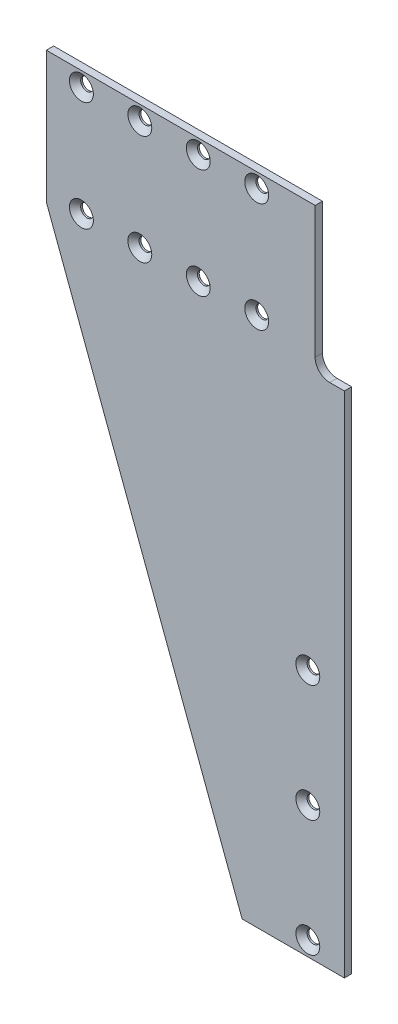
ISO-10303-21;
HEADER;
FILE_DESCRIPTION(('STEP AP214'),'2;1');
FILE_NAME('part.step','',(''),(''),'','','');
FILE_SCHEMA(('AUTOMOTIVE_DESIGN { 1 0 10303 214 1 1 1 1 }'));
ENDSEC;
DATA;
#1=APPLICATION_CONTEXT('core data for automotive mechanical design processes');
#2=APPLICATION_PROTOCOL_DEFINITION('international standard','automotive_design',2000,#1);
#3=PRODUCT_CONTEXT('',#1,'mechanical');
#4=PRODUCT('Part','Part','',(#3));
#5=PRODUCT_RELATED_PRODUCT_CATEGORY('part','',(#4));
#6=PRODUCT_DEFINITION_FORMATION('','',#4);
#7=PRODUCT_DEFINITION_CONTEXT('part definition',#1,'design');
#8=PRODUCT_DEFINITION('design','',#6,#7);
#9=PRODUCT_DEFINITION_SHAPE('','',#8);
#10=(LENGTH_UNIT() NAMED_UNIT(*) SI_UNIT(.MILLI.,.METRE.));
#11=(NAMED_UNIT(*) PLANE_ANGLE_UNIT() SI_UNIT($,.RADIAN.));
#12=(NAMED_UNIT(*) SI_UNIT($,.STERADIAN.) SOLID_ANGLE_UNIT());
#13=UNCERTAINTY_MEASURE_WITH_UNIT(LENGTH_MEASURE(1.E-05),#10,'distance_accuracy_value','');
#14=(GEOMETRIC_REPRESENTATION_CONTEXT(3) GLOBAL_UNCERTAINTY_ASSIGNED_CONTEXT((#13)) GLOBAL_UNIT_ASSIGNED_CONTEXT((#10,
#11,#12)) REPRESENTATION_CONTEXT('',''));
#15=CARTESIAN_POINT('',(0.,0.,0.));
#16=DIRECTION('',(0.,0.,1.));
#17=DIRECTION('',(1.,0.,0.));
#18=AXIS2_PLACEMENT_3D('',#15,#16,#17);
#19=CARTESIAN_POINT('',(-44.45,0.,-3.175));
#20=DIRECTION('',(0.,-1.,0.));
#21=DIRECTION('',(0.,0.,-1.));
#22=AXIS2_PLACEMENT_3D('',#19,#20,#21);
#23=PLANE('',#22);
#24=DIRECTION('',(1.,0.,0.));
#25=VECTOR('',#24,1.);
#26=CARTESIAN_POINT('',(-44.45,0.,0.));
#27=LINE('',#26,#25);
#28=CARTESIAN_POINT('',(-44.45,0.,0.));
#29=VERTEX_POINT('',#28);
#30=CARTESIAN_POINT('',(0.,0.,0.));
#31=VERTEX_POINT('',#30);
#32=EDGE_CURVE('E130',#29,#31,#27,.T.);
#33=ORIENTED_EDGE('',*,*,#32,.F.);
#34=DIRECTION('',(0.,0.,1.));
#35=VECTOR('',#34,1.);
#36=CARTESIAN_POINT('',(-44.45,0.,-3.175));
#37=LINE('',#36,#35);
#38=CARTESIAN_POINT('',(-44.45,0.,-3.175));
#39=VERTEX_POINT('',#38);
#40=EDGE_CURVE('E11',#39,#29,#37,.T.);
#41=ORIENTED_EDGE('',*,*,#40,.F.);
#42=DIRECTION('',(1.,0.,0.));
#43=VECTOR('',#42,1.);
#44=CARTESIAN_POINT('',(-44.45,0.,-3.175));
#45=LINE('',#44,#43);
#46=CARTESIAN_POINT('',(0.,0.,-3.175));
#47=VERTEX_POINT('',#46);
#48=EDGE_CURVE('E151',#39,#47,#45,.T.);
#49=ORIENTED_EDGE('',*,*,#48,.T.);
#50=DIRECTION('',(0.,0.,1.));
#51=VECTOR('',#50,1.);
#52=CARTESIAN_POINT('',(0.,0.,-3.175));
#53=LINE('',#52,#51);
#54=EDGE_CURVE('E36',#47,#31,#53,.T.);
#55=ORIENTED_EDGE('',*,*,#54,.T.);
#56=EDGE_LOOP('',(#33,#41,#49,#55));
#57=FACE_BOUND('',#56,.T.);
#58=ADVANCED_FACE('F33',(#57),#23,.T.);
#59=CARTESIAN_POINT('',(-129.54,227.33,-3.175));
#60=DIRECTION('',(-0.9365440193853,-0.350549996082766,0.));
#61=DIRECTION('',(0.350549996082766,-0.9365440193853,0.));
#62=AXIS2_PLACEMENT_3D('',#59,#60,#61);
#63=PLANE('',#62);
#64=DIRECTION('',(0.350549996082766,-0.9365440193853,0.));
#65=VECTOR('',#64,1.);
#66=CARTESIAN_POINT('',(-129.54,227.33,0.));
#67=LINE('',#66,#65);
#68=CARTESIAN_POINT('',(-129.54,227.33,0.));
#69=VERTEX_POINT('',#68);
#70=EDGE_CURVE('E149',#69,#29,#67,.T.);
#71=ORIENTED_EDGE('',*,*,#70,.F.);
#72=DIRECTION('',(0.,0.,1.));
#73=VECTOR('',#72,1.);
#74=CARTESIAN_POINT('',(-129.54,227.33,-3.175));
#75=LINE('',#74,#73);
#76=CARTESIAN_POINT('',(-129.54,227.33,-3.175));
#77=VERTEX_POINT('',#76);
#78=EDGE_CURVE('E42',#77,#69,#75,.T.);
#79=ORIENTED_EDGE('',*,*,#78,.F.);
#80=DIRECTION('',(0.350549996082766,-0.9365440193853,0.));
#81=VECTOR('',#80,1.);
#82=CARTESIAN_POINT('',(-129.54,227.33,-3.175));
#83=LINE('',#82,#81);
#84=EDGE_CURVE('E120',#77,#39,#83,.T.);
#85=ORIENTED_EDGE('',*,*,#84,.T.);
#86=ORIENTED_EDGE('',*,*,#40,.T.);
#87=EDGE_LOOP('',(#71,#79,#85,#86));
#88=FACE_BOUND('',#87,.T.);
#89=ADVANCED_FACE('F163',(#88),#63,.T.);
#90=CARTESIAN_POINT('',(-129.54,284.48,-3.175));
#91=DIRECTION('',(-1.,0.,0.));
#92=DIRECTION('',(0.,-1.,0.));
#93=AXIS2_PLACEMENT_3D('',#90,#91,#92);
#94=PLANE('',#93);
#95=DIRECTION('',(0.,-1.,0.));
#96=VECTOR('',#95,1.);
#97=CARTESIAN_POINT('',(-129.54,284.48,0.));
#98=LINE('',#97,#96);
#99=CARTESIAN_POINT('',(-129.54,284.48,0.));
#100=VERTEX_POINT('',#99);
#101=EDGE_CURVE('E107',#100,#69,#98,.T.);
#102=ORIENTED_EDGE('',*,*,#101,.F.);
#103=DIRECTION('',(0.,0.,1.));
#104=VECTOR('',#103,1.);
#105=CARTESIAN_POINT('',(-129.54,284.48,-3.175));
#106=LINE('',#105,#104);
#107=CARTESIAN_POINT('',(-129.54,284.48,-3.175));
#108=VERTEX_POINT('',#107);
#109=EDGE_CURVE('E102',#108,#100,#106,.T.);
#110=ORIENTED_EDGE('',*,*,#109,.F.);
#111=DIRECTION('',(0.,-1.,0.));
#112=VECTOR('',#111,1.);
#113=CARTESIAN_POINT('',(-129.54,284.48,-3.175));
#114=LINE('',#113,#112);
#115=EDGE_CURVE('E105',#108,#77,#114,.T.);
#116=ORIENTED_EDGE('',*,*,#115,.T.);
#117=ORIENTED_EDGE('',*,*,#78,.T.);
#118=EDGE_LOOP('',(#102,#110,#116,#117));
#119=FACE_BOUND('',#118,.T.);
#120=ADVANCED_FACE('F104',(#119),#94,.T.);
#121=CARTESIAN_POINT('',(-12.7,284.48,-3.175));
#122=DIRECTION('',(0.,1.,0.));
#123=DIRECTION('',(0.,0.,1.));
#124=AXIS2_PLACEMENT_3D('',#121,#122,#123);
#125=PLANE('',#124);
#126=DIRECTION('',(-1.,0.,0.));
#127=VECTOR('',#126,1.);
#128=CARTESIAN_POINT('',(-12.7,284.48,0.));
#129=LINE('',#128,#127);
#130=CARTESIAN_POINT('',(-12.7,284.48,0.));
#131=VERTEX_POINT('',#130);
#132=EDGE_CURVE('E146',#131,#100,#129,.T.);
#133=ORIENTED_EDGE('',*,*,#132,.F.);
#134=DIRECTION('',(0.,0.,1.));
#135=VECTOR('',#134,1.);
#136=CARTESIAN_POINT('',(-12.7,284.48,-3.175));
#137=LINE('',#136,#135);
#138=CARTESIAN_POINT('',(-12.7,284.48,-3.175));
#139=VERTEX_POINT('',#138);
#140=EDGE_CURVE('E112',#139,#131,#137,.T.);
#141=ORIENTED_EDGE('',*,*,#140,.F.);
#142=DIRECTION('',(-1.,0.,0.));
#143=VECTOR('',#142,1.);
#144=CARTESIAN_POINT('',(-12.7,284.48,-3.175));
#145=LINE('',#144,#143);
#146=EDGE_CURVE('E118',#139,#108,#145,.T.);
#147=ORIENTED_EDGE('',*,*,#146,.T.);
#148=ORIENTED_EDGE('',*,*,#109,.T.);
#149=EDGE_LOOP('',(#133,#141,#147,#148));
#150=FACE_BOUND('',#149,.T.);
#151=ADVANCED_FACE('F122',(#150),#125,.T.);
#152=CARTESIAN_POINT('',(-12.7,284.48,-3.175));
#153=DIRECTION('',(1.,0.,0.));
#154=DIRECTION('',(0.,1.,0.));
#155=AXIS2_PLACEMENT_3D('',#152,#153,#154);
#156=PLANE('',#155);
#157=DIRECTION('',(0.,1.,0.));
#158=VECTOR('',#157,1.);
#159=CARTESIAN_POINT('',(-12.7,284.48,0.));
#160=LINE('',#159,#158);
#161=CARTESIAN_POINT('',(-12.7,227.33,0.));
#162=VERTEX_POINT('',#161);
#163=EDGE_CURVE('E143',#162,#131,#160,.T.);
#164=ORIENTED_EDGE('',*,*,#163,.F.);
#165=DIRECTION('',(0.,0.,1.));
#166=VECTOR('',#165,1.);
#167=CARTESIAN_POINT('',(-12.7,227.33,-3.175));
#168=LINE('',#167,#166);
#169=CARTESIAN_POINT('',(-12.7,227.33,-3.175));
#170=VERTEX_POINT('',#169);
#171=EDGE_CURVE('E155',#170,#162,#168,.T.);
#172=ORIENTED_EDGE('',*,*,#171,.F.);
#173=DIRECTION('',(0.,1.,0.));
#174=VECTOR('',#173,1.);
#175=CARTESIAN_POINT('',(-12.7,284.48,-3.175));
#176=LINE('',#175,#174);
#177=EDGE_CURVE('E123',#170,#139,#176,.T.);
#178=ORIENTED_EDGE('',*,*,#177,.T.);
#179=ORIENTED_EDGE('',*,*,#140,.T.);
#180=EDGE_LOOP('',(#164,#172,#178,#179));
#181=FACE_BOUND('',#180,.T.);
#182=ADVANCED_FACE('F176',(#181),#156,.T.);
#183=CARTESIAN_POINT('',(-6.35,227.33,-3.175));
#184=DIRECTION('',(0.,0.,1.));
#185=DIRECTION('',(1.,0.,0.));
#186=AXIS2_PLACEMENT_3D('',#183,#184,#185);
#187=CYLINDRICAL_SURFACE('',#186,6.35);
#188=CARTESIAN_POINT('',(-6.35,227.33,0.));
#189=DIRECTION('',(0.,0.,-1.));
#190=DIRECTION('',(1.,0.,0.));
#191=AXIS2_PLACEMENT_3D('',#188,#189,#190);
#192=CIRCLE('',#191,6.35);
#193=CARTESIAN_POINT('',(-6.35,220.98,0.));
#194=VERTEX_POINT('',#193);
#195=EDGE_CURVE('E140',#194,#162,#192,.T.);
#196=ORIENTED_EDGE('',*,*,#195,.F.);
#197=DIRECTION('',(0.,0.,1.));
#198=VECTOR('',#197,1.);
#199=CARTESIAN_POINT('',(-6.35,220.98,-3.175));
#200=LINE('',#199,#198);
#201=CARTESIAN_POINT('',(-6.35,220.98,-3.175));
#202=VERTEX_POINT('',#201);
#203=EDGE_CURVE('E157',#202,#194,#200,.T.);
#204=ORIENTED_EDGE('',*,*,#203,.F.);
#205=CARTESIAN_POINT('',(-6.35,227.33,-3.175));
#206=DIRECTION('',(0.,0.,-1.));
#207=DIRECTION('',(1.,0.,0.));
#208=AXIS2_PLACEMENT_3D('',#205,#206,#207);
#209=CIRCLE('',#208,6.35);
#210=EDGE_CURVE('E125',#202,#170,#209,.T.);
#211=ORIENTED_EDGE('',*,*,#210,.T.);
#212=ORIENTED_EDGE('',*,*,#171,.T.);
#213=EDGE_LOOP('',(#196,#204,#211,#212));
#214=FACE_BOUND('',#213,.T.);
#215=ADVANCED_FACE('F179',(#214),#187,.F.);
#216=CARTESIAN_POINT('',(-6.35,220.98,-3.175));
#217=DIRECTION('',(0.,1.,0.));
#218=DIRECTION('',(0.,0.,1.));
#219=AXIS2_PLACEMENT_3D('',#216,#217,#218);
#220=PLANE('',#219);
#221=DIRECTION('',(-1.,0.,0.));
#222=VECTOR('',#221,1.);
#223=CARTESIAN_POINT('',(-6.35,220.98,0.));
#224=LINE('',#223,#222);
#225=CARTESIAN_POINT('',(0.,220.98,0.));
#226=VERTEX_POINT('',#225);
#227=EDGE_CURVE('E137',#226,#194,#224,.T.);
#228=ORIENTED_EDGE('',*,*,#227,.F.);
#229=DIRECTION('',(0.,0.,1.));
#230=VECTOR('',#229,1.);
#231=CARTESIAN_POINT('',(0.,220.98,-3.175));
#232=LINE('',#231,#230);
#233=CARTESIAN_POINT('',(0.,220.98,-3.175));
#234=VERTEX_POINT('',#233);
#235=EDGE_CURVE('E158',#234,#226,#232,.T.);
#236=ORIENTED_EDGE('',*,*,#235,.F.);
#237=DIRECTION('',(-1.,0.,0.));
#238=VECTOR('',#237,1.);
#239=CARTESIAN_POINT('',(-6.35,220.98,-3.175));
#240=LINE('',#239,#238);
#241=EDGE_CURVE('E393',#234,#202,#240,.T.);
#242=ORIENTED_EDGE('',*,*,#241,.T.);
#243=ORIENTED_EDGE('',*,*,#203,.T.);
#244=EDGE_LOOP('',(#228,#236,#242,#243));
#245=FACE_BOUND('',#244,.T.);
#246=ADVANCED_FACE('F183',(#245),#220,.T.);
#247=CARTESIAN_POINT('',(0.,0.,-3.175));
#248=DIRECTION('',(1.,0.,0.));
#249=DIRECTION('',(0.,0.,-1.));
#250=AXIS2_PLACEMENT_3D('',#247,#248,#249);
#251=PLANE('',#250);
#252=DIRECTION('',(0.,1.,0.));
#253=VECTOR('',#252,1.);
#254=CARTESIAN_POINT('',(0.,0.,0.));
#255=LINE('',#254,#253);
#256=EDGE_CURVE('E133',#31,#226,#255,.T.);
#257=ORIENTED_EDGE('',*,*,#256,.F.);
#258=ORIENTED_EDGE('',*,*,#54,.F.);
#259=DIRECTION('',(0.,1.,0.));
#260=VECTOR('',#259,1.);
#261=CARTESIAN_POINT('',(0.,0.,-3.175));
#262=LINE('',#261,#260);
#263=EDGE_CURVE('E391',#47,#234,#262,.T.);
#264=ORIENTED_EDGE('',*,*,#263,.T.);
#265=ORIENTED_EDGE('',*,*,#235,.T.);
#266=EDGE_LOOP('',(#257,#258,#264,#265));
#267=FACE_BOUND('',#266,.T.);
#268=ADVANCED_FACE('F160',(#267),#251,.T.);
#269=CARTESIAN_POINT('',(-6.35,227.33,-3.175));
#270=DIRECTION('',(0.,0.,1.));
#271=DIRECTION('',(1.,0.,0.));
#272=AXIS2_PLACEMENT_3D('',#269,#270,#271);
#273=PLANE('',#272);
#274=CARTESIAN_POINT('',(-15.875,6.34999999999999,-3.175));
#275=DIRECTION('',(0.,0.,1.));
#276=DIRECTION('',(1.,0.,0.));
#277=AXIS2_PLACEMENT_3D('',#274,#275,#276);
#278=CIRCLE('',#277,2.75589999999999);
#279=CARTESIAN_POINT('',(-13.1191,6.34999999999999,-3.175));
#280=VERTEX_POINT('',#279);
#281=EDGE_CURVE('E297',#280,#280,#278,.T.);
#282=ORIENTED_EDGE('',*,*,#281,.T.);
#283=EDGE_LOOP('',(#282));
#284=FACE_BOUND('',#283,.T.);
#285=CARTESIAN_POINT('',(-15.875,57.15,-3.175));
#286=DIRECTION('',(0.,0.,1.));
#287=DIRECTION('',(1.,0.,0.));
#288=AXIS2_PLACEMENT_3D('',#285,#286,#287);
#289=CIRCLE('',#288,2.75589999999999);
#290=CARTESIAN_POINT('',(-13.1191,57.15,-3.175));
#291=VERTEX_POINT('',#290);
#292=EDGE_CURVE('E307',#291,#291,#289,.T.);
#293=ORIENTED_EDGE('',*,*,#292,.T.);
#294=EDGE_LOOP('',(#293));
#295=FACE_BOUND('',#294,.T.);
#296=CARTESIAN_POINT('',(-15.875,107.95,-3.175));
#297=DIRECTION('',(0.,0.,1.));
#298=DIRECTION('',(1.,0.,0.));
#299=AXIS2_PLACEMENT_3D('',#296,#297,#298);
#300=CIRCLE('',#299,2.75589999999999);
#301=CARTESIAN_POINT('',(-13.1191,107.95,-3.175));
#302=VERTEX_POINT('',#301);
#303=EDGE_CURVE('E316',#302,#302,#300,.T.);
#304=ORIENTED_EDGE('',*,*,#303,.T.);
#305=EDGE_LOOP('',(#304));
#306=FACE_BOUND('',#305,.T.);
#307=CARTESIAN_POINT('',(-38.1,278.13,-3.175));
#308=DIRECTION('',(0.,0.,1.));
#309=DIRECTION('',(1.,0.,0.));
#310=AXIS2_PLACEMENT_3D('',#307,#308,#309);
#311=CIRCLE('',#310,2.7559);
#312=CARTESIAN_POINT('',(-35.3441,278.13,-3.175));
#313=VERTEX_POINT('',#312);
#314=EDGE_CURVE('E325',#313,#313,#311,.T.);
#315=ORIENTED_EDGE('',*,*,#314,.T.);
#316=EDGE_LOOP('',(#315));
#317=FACE_BOUND('',#316,.T.);
#318=CARTESIAN_POINT('',(-38.1,230.505,-3.175));
#319=DIRECTION('',(0.,0.,1.));
#320=DIRECTION('',(1.,0.,0.));
#321=AXIS2_PLACEMENT_3D('',#318,#319,#320);
#322=CIRCLE('',#321,2.7559);
#323=CARTESIAN_POINT('',(-35.3441,230.505,-3.175));
#324=VERTEX_POINT('',#323);
#325=EDGE_CURVE('E334',#324,#324,#322,.T.);
#326=ORIENTED_EDGE('',*,*,#325,.T.);
#327=EDGE_LOOP('',(#326));
#328=FACE_BOUND('',#327,.T.);
#329=CARTESIAN_POINT('',(-63.5,278.13,-3.175));
#330=DIRECTION('',(0.,0.,1.));
#331=DIRECTION('',(1.,0.,0.));
#332=AXIS2_PLACEMENT_3D('',#329,#330,#331);
#333=CIRCLE('',#332,2.7559);
#334=CARTESIAN_POINT('',(-60.7441,278.13,-3.175));
#335=VERTEX_POINT('',#334);
#336=EDGE_CURVE('E343',#335,#335,#333,.T.);
#337=ORIENTED_EDGE('',*,*,#336,.T.);
#338=EDGE_LOOP('',(#337));
#339=FACE_BOUND('',#338,.T.);
#340=CARTESIAN_POINT('',(-63.5,230.505,-3.175));
#341=DIRECTION('',(0.,0.,1.));
#342=DIRECTION('',(1.,0.,0.));
#343=AXIS2_PLACEMENT_3D('',#340,#341,#342);
#344=CIRCLE('',#343,2.7559);
#345=CARTESIAN_POINT('',(-60.7441,230.505,-3.175));
#346=VERTEX_POINT('',#345);
#347=EDGE_CURVE('E352',#346,#346,#344,.T.);
#348=ORIENTED_EDGE('',*,*,#347,.T.);
#349=EDGE_LOOP('',(#348));
#350=FACE_BOUND('',#349,.T.);
#351=CARTESIAN_POINT('',(-88.9,278.13,-3.175));
#352=DIRECTION('',(0.,0.,1.));
#353=DIRECTION('',(1.,0.,0.));
#354=AXIS2_PLACEMENT_3D('',#351,#352,#353);
#355=CIRCLE('',#354,2.75590000000001);
#356=CARTESIAN_POINT('',(-86.1441,278.13,-3.175));
#357=VERTEX_POINT('',#356);
#358=EDGE_CURVE('E361',#357,#357,#355,.T.);
#359=ORIENTED_EDGE('',*,*,#358,.T.);
#360=EDGE_LOOP('',(#359));
#361=FACE_BOUND('',#360,.T.);
#362=CARTESIAN_POINT('',(-88.9,230.505,-3.175));
#363=DIRECTION('',(0.,0.,1.));
#364=DIRECTION('',(1.,0.,0.));
#365=AXIS2_PLACEMENT_3D('',#362,#363,#364);
#366=CIRCLE('',#365,2.75590000000001);
#367=CARTESIAN_POINT('',(-86.1441,230.505,-3.175));
#368=VERTEX_POINT('',#367);
#369=EDGE_CURVE('E370',#368,#368,#366,.T.);
#370=ORIENTED_EDGE('',*,*,#369,.T.);
#371=EDGE_LOOP('',(#370));
#372=FACE_BOUND('',#371,.T.);
#373=CARTESIAN_POINT('',(-114.3,278.13,-3.175));
#374=DIRECTION('',(0.,0.,1.));
#375=DIRECTION('',(1.,0.,0.));
#376=AXIS2_PLACEMENT_3D('',#373,#374,#375);
#377=CIRCLE('',#376,2.75590000000001);
#378=CARTESIAN_POINT('',(-111.5441,278.13,-3.175));
#379=VERTEX_POINT('',#378);
#380=EDGE_CURVE('E379',#379,#379,#377,.T.);
#381=ORIENTED_EDGE('',*,*,#380,.T.);
#382=EDGE_LOOP('',(#381));
#383=FACE_BOUND('',#382,.T.);
#384=CARTESIAN_POINT('',(-114.3,230.505,-3.175));
#385=DIRECTION('',(0.,0.,1.));
#386=DIRECTION('',(1.,0.,0.));
#387=AXIS2_PLACEMENT_3D('',#384,#385,#386);
#388=CIRCLE('',#387,2.75590000000001);
#389=CARTESIAN_POINT('',(-111.5441,230.505,-3.175));
#390=VERTEX_POINT('',#389);
#391=EDGE_CURVE('E134',#390,#390,#388,.T.);
#392=ORIENTED_EDGE('',*,*,#391,.T.);
#393=EDGE_LOOP('',(#392));
#394=FACE_BOUND('',#393,.T.);
#395=ORIENTED_EDGE('',*,*,#48,.F.);
#396=ORIENTED_EDGE('',*,*,#84,.F.);
#397=ORIENTED_EDGE('',*,*,#115,.F.);
#398=ORIENTED_EDGE('',*,*,#146,.F.);
#399=ORIENTED_EDGE('',*,*,#177,.F.);
#400=ORIENTED_EDGE('',*,*,#210,.F.);
#401=ORIENTED_EDGE('',*,*,#241,.F.);
#402=ORIENTED_EDGE('',*,*,#263,.F.);
#403=EDGE_LOOP('',(#395,#396,#397,#398,#399,#400,#401,#402));
#404=FACE_BOUND('',#403,.T.);
#405=ADVANCED_FACE('F116',(#284,#295,#306,#317,#328,#339,#350,#361,#372,#383,#394,#404),#273,.F.);
#406=CARTESIAN_POINT('',(-6.35,227.33,0.));
#407=DIRECTION('',(0.,0.,1.));
#408=DIRECTION('',(1.,0.,0.));
#409=AXIS2_PLACEMENT_3D('',#406,#407,#408);
#410=PLANE('',#409);
#411=CARTESIAN_POINT('',(-15.875,6.34999999999999,0.));
#412=DIRECTION('',(0.,0.,1.));
#413=DIRECTION('',(1.,0.,0.));
#414=AXIS2_PLACEMENT_3D('',#411,#412,#413);
#415=CIRCLE('',#414,5.1943);
#416=CARTESIAN_POINT('',(-10.6807,6.34999999999999,0.));
#417=VERTEX_POINT('',#416);
#418=EDGE_CURVE('E295',#417,#417,#415,.T.);
#419=ORIENTED_EDGE('',*,*,#418,.F.);
#420=EDGE_LOOP('',(#419));
#421=FACE_BOUND('',#420,.T.);
#422=CARTESIAN_POINT('',(-15.875,57.15,0.));
#423=DIRECTION('',(0.,0.,1.));
#424=DIRECTION('',(1.,0.,0.));
#425=AXIS2_PLACEMENT_3D('',#422,#423,#424);
#426=CIRCLE('',#425,5.1943);
#427=CARTESIAN_POINT('',(-10.6807,57.15,0.));
#428=VERTEX_POINT('',#427);
#429=EDGE_CURVE('E301',#428,#428,#426,.T.);
#430=ORIENTED_EDGE('',*,*,#429,.F.);
#431=EDGE_LOOP('',(#430));
#432=FACE_BOUND('',#431,.T.);
#433=CARTESIAN_POINT('',(-15.875,107.95,0.));
#434=DIRECTION('',(0.,0.,1.));
#435=DIRECTION('',(1.,0.,0.));
#436=AXIS2_PLACEMENT_3D('',#433,#434,#435);
#437=CIRCLE('',#436,5.1943);
#438=CARTESIAN_POINT('',(-10.6807,107.95,0.));
#439=VERTEX_POINT('',#438);
#440=EDGE_CURVE('E310',#439,#439,#437,.T.);
#441=ORIENTED_EDGE('',*,*,#440,.F.);
#442=EDGE_LOOP('',(#441));
#443=FACE_BOUND('',#442,.T.);
#444=CARTESIAN_POINT('',(-38.1,278.13,0.));
#445=DIRECTION('',(0.,0.,1.));
#446=DIRECTION('',(1.,0.,0.));
#447=AXIS2_PLACEMENT_3D('',#444,#445,#446);
#448=CIRCLE('',#447,5.1943);
#449=CARTESIAN_POINT('',(-32.9057,278.13,0.));
#450=VERTEX_POINT('',#449);
#451=EDGE_CURVE('E319',#450,#450,#448,.T.);
#452=ORIENTED_EDGE('',*,*,#451,.F.);
#453=EDGE_LOOP('',(#452));
#454=FACE_BOUND('',#453,.T.);
#455=CARTESIAN_POINT('',(-38.1,230.505,0.));
#456=DIRECTION('',(0.,0.,1.));
#457=DIRECTION('',(1.,0.,0.));
#458=AXIS2_PLACEMENT_3D('',#455,#456,#457);
#459=CIRCLE('',#458,5.1943);
#460=CARTESIAN_POINT('',(-32.9057,230.505,0.));
#461=VERTEX_POINT('',#460);
#462=EDGE_CURVE('E328',#461,#461,#459,.T.);
#463=ORIENTED_EDGE('',*,*,#462,.F.);
#464=EDGE_LOOP('',(#463));
#465=FACE_BOUND('',#464,.T.);
#466=CARTESIAN_POINT('',(-63.5,278.13,0.));
#467=DIRECTION('',(0.,0.,1.));
#468=DIRECTION('',(1.,0.,0.));
#469=AXIS2_PLACEMENT_3D('',#466,#467,#468);
#470=CIRCLE('',#469,5.1943);
#471=CARTESIAN_POINT('',(-58.3057,278.13,0.));
#472=VERTEX_POINT('',#471);
#473=EDGE_CURVE('E337',#472,#472,#470,.T.);
#474=ORIENTED_EDGE('',*,*,#473,.F.);
#475=EDGE_LOOP('',(#474));
#476=FACE_BOUND('',#475,.T.);
#477=CARTESIAN_POINT('',(-63.5,230.505,0.));
#478=DIRECTION('',(0.,0.,1.));
#479=DIRECTION('',(1.,0.,0.));
#480=AXIS2_PLACEMENT_3D('',#477,#478,#479);
#481=CIRCLE('',#480,5.1943);
#482=CARTESIAN_POINT('',(-58.3057,230.505,0.));
#483=VERTEX_POINT('',#482);
#484=EDGE_CURVE('E346',#483,#483,#481,.T.);
#485=ORIENTED_EDGE('',*,*,#484,.F.);
#486=EDGE_LOOP('',(#485));
#487=FACE_BOUND('',#486,.T.);
#488=CARTESIAN_POINT('',(-88.9,278.13,0.));
#489=DIRECTION('',(0.,0.,1.));
#490=DIRECTION('',(1.,0.,0.));
#491=AXIS2_PLACEMENT_3D('',#488,#489,#490);
#492=CIRCLE('',#491,5.1943);
#493=CARTESIAN_POINT('',(-83.7057,278.13,0.));
#494=VERTEX_POINT('',#493);
#495=EDGE_CURVE('E355',#494,#494,#492,.T.);
#496=ORIENTED_EDGE('',*,*,#495,.F.);
#497=EDGE_LOOP('',(#496));
#498=FACE_BOUND('',#497,.T.);
#499=CARTESIAN_POINT('',(-88.9,230.505,0.));
#500=DIRECTION('',(0.,0.,1.));
#501=DIRECTION('',(1.,0.,0.));
#502=AXIS2_PLACEMENT_3D('',#499,#500,#501);
#503=CIRCLE('',#502,5.1943);
#504=CARTESIAN_POINT('',(-83.7057,230.505,0.));
#505=VERTEX_POINT('',#504);
#506=EDGE_CURVE('E364',#505,#505,#503,.T.);
#507=ORIENTED_EDGE('',*,*,#506,.F.);
#508=EDGE_LOOP('',(#507));
#509=FACE_BOUND('',#508,.T.);
#510=CARTESIAN_POINT('',(-114.3,278.13,0.));
#511=DIRECTION('',(0.,0.,1.));
#512=DIRECTION('',(1.,0.,0.));
#513=AXIS2_PLACEMENT_3D('',#510,#511,#512);
#514=CIRCLE('',#513,5.1943);
#515=CARTESIAN_POINT('',(-109.1057,278.13,0.));
#516=VERTEX_POINT('',#515);
#517=EDGE_CURVE('E373',#516,#516,#514,.T.);
#518=ORIENTED_EDGE('',*,*,#517,.F.);
#519=EDGE_LOOP('',(#518));
#520=FACE_BOUND('',#519,.T.);
#521=CARTESIAN_POINT('',(-114.3,230.505,0.));
#522=DIRECTION('',(0.,0.,1.));
#523=DIRECTION('',(1.,0.,0.));
#524=AXIS2_PLACEMENT_3D('',#521,#522,#523);
#525=CIRCLE('',#524,5.1943);
#526=CARTESIAN_POINT('',(-109.1057,230.505,0.));
#527=VERTEX_POINT('',#526);
#528=EDGE_CURVE('E382',#527,#527,#525,.T.);
#529=ORIENTED_EDGE('',*,*,#528,.F.);
#530=EDGE_LOOP('',(#529));
#531=FACE_BOUND('',#530,.T.);
#532=ORIENTED_EDGE('',*,*,#32,.T.);
#533=ORIENTED_EDGE('',*,*,#256,.T.);
#534=ORIENTED_EDGE('',*,*,#227,.T.);
#535=ORIENTED_EDGE('',*,*,#195,.T.);
#536=ORIENTED_EDGE('',*,*,#163,.T.);
#537=ORIENTED_EDGE('',*,*,#132,.T.);
#538=ORIENTED_EDGE('',*,*,#101,.T.);
#539=ORIENTED_EDGE('',*,*,#70,.T.);
#540=EDGE_LOOP('',(#532,#533,#534,#535,#536,#537,#538,#539));
#541=FACE_BOUND('',#540,.T.);
#542=ADVANCED_FACE('F162',(#421,#432,#443,#454,#465,#476,#487,#498,#509,#520,#531,#541),#410,.T.);
#543=CARTESIAN_POINT('',(-114.3,230.505,0.));
#544=DIRECTION('',(0.,0.,1.));
#545=DIRECTION('',(1.,0.,0.));
#546=AXIS2_PLACEMENT_3D('',#543,#544,#545);
#547=CYLINDRICAL_SURFACE('',#546,2.75590000000001);
#548=ORIENTED_EDGE('',*,*,#391,.F.);
#549=EDGE_LOOP('',(#548));
#550=FACE_BOUND('',#549,.T.);
#551=CARTESIAN_POINT('',(-114.3,230.505,-2.4384));
#552=DIRECTION('',(0.,0.,1.));
#553=DIRECTION('',(1.,0.,0.));
#554=AXIS2_PLACEMENT_3D('',#551,#552,#553);
#555=CIRCLE('',#554,2.75590000000001);
#556=CARTESIAN_POINT('',(-111.5441,230.505,-2.4384));
#557=VERTEX_POINT('',#556);
#558=EDGE_CURVE('E385',#557,#557,#555,.T.);
#559=ORIENTED_EDGE('',*,*,#558,.T.);
#560=EDGE_LOOP('',(#559));
#561=FACE_BOUND('',#560,.T.);
#562=ADVANCED_FACE('F196',(#550,#561),#547,.F.);
#563=CARTESIAN_POINT('',(-114.3,230.505,0.));
#564=DIRECTION('',(0.,0.,1.));
#565=DIRECTION('',(1.,0.,0.));
#566=AXIS2_PLACEMENT_3D('',#563,#564,#565);
#567=CONICAL_SURFACE('',#566,5.1943,0.785398163397447);
#568=ORIENTED_EDGE('',*,*,#558,.F.);
#569=EDGE_LOOP('',(#568));
#570=FACE_BOUND('',#569,.T.);
#571=ORIENTED_EDGE('',*,*,#528,.T.);
#572=EDGE_LOOP('',(#571));
#573=FACE_BOUND('',#572,.T.);
#574=ADVANCED_FACE('F203',(#570,#573),#567,.F.);
#575=CARTESIAN_POINT('',(-114.3,278.13,0.));
#576=DIRECTION('',(0.,0.,1.));
#577=DIRECTION('',(1.,0.,0.));
#578=AXIS2_PLACEMENT_3D('',#575,#576,#577);
#579=CYLINDRICAL_SURFACE('',#578,2.75590000000001);
#580=ORIENTED_EDGE('',*,*,#380,.F.);
#581=EDGE_LOOP('',(#580));
#582=FACE_BOUND('',#581,.T.);
#583=CARTESIAN_POINT('',(-114.3,278.13,-2.4384));
#584=DIRECTION('',(0.,0.,1.));
#585=DIRECTION('',(1.,0.,0.));
#586=AXIS2_PLACEMENT_3D('',#583,#584,#585);
#587=CIRCLE('',#586,2.75590000000001);
#588=CARTESIAN_POINT('',(-111.5441,278.13,-2.4384));
#589=VERTEX_POINT('',#588);
#590=EDGE_CURVE('E376',#589,#589,#587,.T.);
#591=ORIENTED_EDGE('',*,*,#590,.T.);
#592=EDGE_LOOP('',(#591));
#593=FACE_BOUND('',#592,.T.);
#594=ADVANCED_FACE('F207',(#582,#593),#579,.F.);
#595=CARTESIAN_POINT('',(-114.3,278.13,0.));
#596=DIRECTION('',(0.,0.,1.));
#597=DIRECTION('',(1.,0.,0.));
#598=AXIS2_PLACEMENT_3D('',#595,#596,#597);
#599=CONICAL_SURFACE('',#598,5.1943,0.785398163397447);
#600=ORIENTED_EDGE('',*,*,#590,.F.);
#601=EDGE_LOOP('',(#600));
#602=FACE_BOUND('',#601,.T.);
#603=ORIENTED_EDGE('',*,*,#517,.T.);
#604=EDGE_LOOP('',(#603));
#605=FACE_BOUND('',#604,.T.);
#606=ADVANCED_FACE('F211',(#602,#605),#599,.F.);
#607=CARTESIAN_POINT('',(-88.9,230.505,0.));
#608=DIRECTION('',(0.,0.,1.));
#609=DIRECTION('',(1.,0.,0.));
#610=AXIS2_PLACEMENT_3D('',#607,#608,#609);
#611=CYLINDRICAL_SURFACE('',#610,2.75590000000001);
#612=ORIENTED_EDGE('',*,*,#369,.F.);
#613=EDGE_LOOP('',(#612));
#614=FACE_BOUND('',#613,.T.);
#615=CARTESIAN_POINT('',(-88.9,230.505,-2.4384));
#616=DIRECTION('',(0.,0.,1.));
#617=DIRECTION('',(1.,0.,0.));
#618=AXIS2_PLACEMENT_3D('',#615,#616,#617);
#619=CIRCLE('',#618,2.75590000000001);
#620=CARTESIAN_POINT('',(-86.1441,230.505,-2.4384));
#621=VERTEX_POINT('',#620);
#622=EDGE_CURVE('E367',#621,#621,#619,.T.);
#623=ORIENTED_EDGE('',*,*,#622,.T.);
#624=EDGE_LOOP('',(#623));
#625=FACE_BOUND('',#624,.T.);
#626=ADVANCED_FACE('F215',(#614,#625),#611,.F.);
#627=CARTESIAN_POINT('',(-88.9,230.505,0.));
#628=DIRECTION('',(0.,0.,1.));
#629=DIRECTION('',(1.,0.,0.));
#630=AXIS2_PLACEMENT_3D('',#627,#628,#629);
#631=CONICAL_SURFACE('',#630,5.1943,0.785398163397447);
#632=ORIENTED_EDGE('',*,*,#622,.F.);
#633=EDGE_LOOP('',(#632));
#634=FACE_BOUND('',#633,.T.);
#635=ORIENTED_EDGE('',*,*,#506,.T.);
#636=EDGE_LOOP('',(#635));
#637=FACE_BOUND('',#636,.T.);
#638=ADVANCED_FACE('F219',(#634,#637),#631,.F.);
#639=CARTESIAN_POINT('',(-88.9,278.13,0.));
#640=DIRECTION('',(0.,0.,1.));
#641=DIRECTION('',(1.,0.,0.));
#642=AXIS2_PLACEMENT_3D('',#639,#640,#641);
#643=CYLINDRICAL_SURFACE('',#642,2.75590000000001);
#644=ORIENTED_EDGE('',*,*,#358,.F.);
#645=EDGE_LOOP('',(#644));
#646=FACE_BOUND('',#645,.T.);
#647=CARTESIAN_POINT('',(-88.9,278.13,-2.4384));
#648=DIRECTION('',(0.,0.,1.));
#649=DIRECTION('',(1.,0.,0.));
#650=AXIS2_PLACEMENT_3D('',#647,#648,#649);
#651=CIRCLE('',#650,2.75590000000001);
#652=CARTESIAN_POINT('',(-86.1441,278.13,-2.4384));
#653=VERTEX_POINT('',#652);
#654=EDGE_CURVE('E358',#653,#653,#651,.T.);
#655=ORIENTED_EDGE('',*,*,#654,.T.);
#656=EDGE_LOOP('',(#655));
#657=FACE_BOUND('',#656,.T.);
#658=ADVANCED_FACE('F223',(#646,#657),#643,.F.);
#659=CARTESIAN_POINT('',(-88.9,278.13,0.));
#660=DIRECTION('',(0.,0.,1.));
#661=DIRECTION('',(1.,0.,0.));
#662=AXIS2_PLACEMENT_3D('',#659,#660,#661);
#663=CONICAL_SURFACE('',#662,5.1943,0.785398163397447);
#664=ORIENTED_EDGE('',*,*,#654,.F.);
#665=EDGE_LOOP('',(#664));
#666=FACE_BOUND('',#665,.T.);
#667=ORIENTED_EDGE('',*,*,#495,.T.);
#668=EDGE_LOOP('',(#667));
#669=FACE_BOUND('',#668,.T.);
#670=ADVANCED_FACE('F227',(#666,#669),#663,.F.);
#671=CARTESIAN_POINT('',(-63.5,230.505,0.));
#672=DIRECTION('',(0.,0.,1.));
#673=DIRECTION('',(1.,0.,0.));
#674=AXIS2_PLACEMENT_3D('',#671,#672,#673);
#675=CYLINDRICAL_SURFACE('',#674,2.7559);
#676=ORIENTED_EDGE('',*,*,#347,.F.);
#677=EDGE_LOOP('',(#676));
#678=FACE_BOUND('',#677,.T.);
#679=CARTESIAN_POINT('',(-63.5,230.505,-2.4384));
#680=DIRECTION('',(0.,0.,1.));
#681=DIRECTION('',(1.,0.,0.));
#682=AXIS2_PLACEMENT_3D('',#679,#680,#681);
#683=CIRCLE('',#682,2.7559);
#684=CARTESIAN_POINT('',(-60.7441,230.505,-2.4384));
#685=VERTEX_POINT('',#684);
#686=EDGE_CURVE('E349',#685,#685,#683,.T.);
#687=ORIENTED_EDGE('',*,*,#686,.T.);
#688=EDGE_LOOP('',(#687));
#689=FACE_BOUND('',#688,.T.);
#690=ADVANCED_FACE('F231',(#678,#689),#675,.F.);
#691=CARTESIAN_POINT('',(-63.5,230.505,0.));
#692=DIRECTION('',(0.,0.,1.));
#693=DIRECTION('',(1.,0.,0.));
#694=AXIS2_PLACEMENT_3D('',#691,#692,#693);
#695=CONICAL_SURFACE('',#694,5.1943,0.785398163397449);
#696=ORIENTED_EDGE('',*,*,#686,.F.);
#697=EDGE_LOOP('',(#696));
#698=FACE_BOUND('',#697,.T.);
#699=ORIENTED_EDGE('',*,*,#484,.T.);
#700=EDGE_LOOP('',(#699));
#701=FACE_BOUND('',#700,.T.);
#702=ADVANCED_FACE('F235',(#698,#701),#695,.F.);
#703=CARTESIAN_POINT('',(-63.5,278.13,0.));
#704=DIRECTION('',(0.,0.,1.));
#705=DIRECTION('',(1.,0.,0.));
#706=AXIS2_PLACEMENT_3D('',#703,#704,#705);
#707=CYLINDRICAL_SURFACE('',#706,2.7559);
#708=ORIENTED_EDGE('',*,*,#336,.F.);
#709=EDGE_LOOP('',(#708));
#710=FACE_BOUND('',#709,.T.);
#711=CARTESIAN_POINT('',(-63.5,278.13,-2.4384));
#712=DIRECTION('',(0.,0.,1.));
#713=DIRECTION('',(1.,0.,0.));
#714=AXIS2_PLACEMENT_3D('',#711,#712,#713);
#715=CIRCLE('',#714,2.7559);
#716=CARTESIAN_POINT('',(-60.7441,278.13,-2.4384));
#717=VERTEX_POINT('',#716);
#718=EDGE_CURVE('E340',#717,#717,#715,.T.);
#719=ORIENTED_EDGE('',*,*,#718,.T.);
#720=EDGE_LOOP('',(#719));
#721=FACE_BOUND('',#720,.T.);
#722=ADVANCED_FACE('F239',(#710,#721),#707,.F.);
#723=CARTESIAN_POINT('',(-63.5,278.13,0.));
#724=DIRECTION('',(0.,0.,1.));
#725=DIRECTION('',(1.,0.,0.));
#726=AXIS2_PLACEMENT_3D('',#723,#724,#725);
#727=CONICAL_SURFACE('',#726,5.1943,0.785398163397449);
#728=ORIENTED_EDGE('',*,*,#718,.F.);
#729=EDGE_LOOP('',(#728));
#730=FACE_BOUND('',#729,.T.);
#731=ORIENTED_EDGE('',*,*,#473,.T.);
#732=EDGE_LOOP('',(#731));
#733=FACE_BOUND('',#732,.T.);
#734=ADVANCED_FACE('F243',(#730,#733),#727,.F.);
#735=CARTESIAN_POINT('',(-38.1,230.505,0.));
#736=DIRECTION('',(0.,0.,1.));
#737=DIRECTION('',(1.,0.,0.));
#738=AXIS2_PLACEMENT_3D('',#735,#736,#737);
#739=CYLINDRICAL_SURFACE('',#738,2.7559);
#740=ORIENTED_EDGE('',*,*,#325,.F.);
#741=EDGE_LOOP('',(#740));
#742=FACE_BOUND('',#741,.T.);
#743=CARTESIAN_POINT('',(-38.1,230.505,-2.4384));
#744=DIRECTION('',(0.,0.,1.));
#745=DIRECTION('',(1.,0.,0.));
#746=AXIS2_PLACEMENT_3D('',#743,#744,#745);
#747=CIRCLE('',#746,2.7559);
#748=CARTESIAN_POINT('',(-35.3441,230.505,-2.4384));
#749=VERTEX_POINT('',#748);
#750=EDGE_CURVE('E331',#749,#749,#747,.T.);
#751=ORIENTED_EDGE('',*,*,#750,.T.);
#752=EDGE_LOOP('',(#751));
#753=FACE_BOUND('',#752,.T.);
#754=ADVANCED_FACE('F247',(#742,#753),#739,.F.);
#755=CARTESIAN_POINT('',(-38.1,230.505,0.));
#756=DIRECTION('',(0.,0.,1.));
#757=DIRECTION('',(1.,0.,0.));
#758=AXIS2_PLACEMENT_3D('',#755,#756,#757);
#759=CONICAL_SURFACE('',#758,5.1943,0.785398163397449);
#760=ORIENTED_EDGE('',*,*,#750,.F.);
#761=EDGE_LOOP('',(#760));
#762=FACE_BOUND('',#761,.T.);
#763=ORIENTED_EDGE('',*,*,#462,.T.);
#764=EDGE_LOOP('',(#763));
#765=FACE_BOUND('',#764,.T.);
#766=ADVANCED_FACE('F251',(#762,#765),#759,.F.);
#767=CARTESIAN_POINT('',(-38.1,278.13,0.));
#768=DIRECTION('',(0.,0.,1.));
#769=DIRECTION('',(1.,0.,0.));
#770=AXIS2_PLACEMENT_3D('',#767,#768,#769);
#771=CYLINDRICAL_SURFACE('',#770,2.7559);
#772=ORIENTED_EDGE('',*,*,#314,.F.);
#773=EDGE_LOOP('',(#772));
#774=FACE_BOUND('',#773,.T.);
#775=CARTESIAN_POINT('',(-38.1,278.13,-2.4384));
#776=DIRECTION('',(0.,0.,1.));
#777=DIRECTION('',(1.,0.,0.));
#778=AXIS2_PLACEMENT_3D('',#775,#776,#777);
#779=CIRCLE('',#778,2.7559);
#780=CARTESIAN_POINT('',(-35.3441,278.13,-2.4384));
#781=VERTEX_POINT('',#780);
#782=EDGE_CURVE('E322',#781,#781,#779,.T.);
#783=ORIENTED_EDGE('',*,*,#782,.T.);
#784=EDGE_LOOP('',(#783));
#785=FACE_BOUND('',#784,.T.);
#786=ADVANCED_FACE('F255',(#774,#785),#771,.F.);
#787=CARTESIAN_POINT('',(-38.1,278.13,0.));
#788=DIRECTION('',(0.,0.,1.));
#789=DIRECTION('',(1.,0.,0.));
#790=AXIS2_PLACEMENT_3D('',#787,#788,#789);
#791=CONICAL_SURFACE('',#790,5.1943,0.785398163397449);
#792=ORIENTED_EDGE('',*,*,#782,.F.);
#793=EDGE_LOOP('',(#792));
#794=FACE_BOUND('',#793,.T.);
#795=ORIENTED_EDGE('',*,*,#451,.T.);
#796=EDGE_LOOP('',(#795));
#797=FACE_BOUND('',#796,.T.);
#798=ADVANCED_FACE('F259',(#794,#797),#791,.F.);
#799=CARTESIAN_POINT('',(-15.875,107.95,0.));
#800=DIRECTION('',(0.,0.,1.));
#801=DIRECTION('',(1.,0.,0.));
#802=AXIS2_PLACEMENT_3D('',#799,#800,#801);
#803=CYLINDRICAL_SURFACE('',#802,2.75589999999999);
#804=ORIENTED_EDGE('',*,*,#303,.F.);
#805=EDGE_LOOP('',(#804));
#806=FACE_BOUND('',#805,.T.);
#807=CARTESIAN_POINT('',(-15.875,107.95,-2.43840000000001));
#808=DIRECTION('',(0.,0.,1.));
#809=DIRECTION('',(1.,0.,0.));
#810=AXIS2_PLACEMENT_3D('',#807,#808,#809);
#811=CIRCLE('',#810,2.75589999999999);
#812=CARTESIAN_POINT('',(-13.1191,107.95,-2.43840000000001));
#813=VERTEX_POINT('',#812);
#814=EDGE_CURVE('E313',#813,#813,#811,.T.);
#815=ORIENTED_EDGE('',*,*,#814,.T.);
#816=EDGE_LOOP('',(#815));
#817=FACE_BOUND('',#816,.T.);
#818=ADVANCED_FACE('F263',(#806,#817),#803,.F.);
#819=CARTESIAN_POINT('',(-15.875,107.95,0.));
#820=DIRECTION('',(0.,0.,1.));
#821=DIRECTION('',(1.,0.,0.));
#822=AXIS2_PLACEMENT_3D('',#819,#820,#821);
#823=CONICAL_SURFACE('',#822,5.1943,0.785398163397449);
#824=ORIENTED_EDGE('',*,*,#814,.F.);
#825=EDGE_LOOP('',(#824));
#826=FACE_BOUND('',#825,.T.);
#827=ORIENTED_EDGE('',*,*,#440,.T.);
#828=EDGE_LOOP('',(#827));
#829=FACE_BOUND('',#828,.T.);
#830=ADVANCED_FACE('F267',(#826,#829),#823,.F.);
#831=CARTESIAN_POINT('',(-15.875,57.15,0.));
#832=DIRECTION('',(0.,0.,1.));
#833=DIRECTION('',(1.,0.,0.));
#834=AXIS2_PLACEMENT_3D('',#831,#832,#833);
#835=CYLINDRICAL_SURFACE('',#834,2.75589999999999);
#836=ORIENTED_EDGE('',*,*,#292,.F.);
#837=EDGE_LOOP('',(#836));
#838=FACE_BOUND('',#837,.T.);
#839=CARTESIAN_POINT('',(-15.875,57.15,-2.43840000000001));
#840=DIRECTION('',(0.,0.,1.));
#841=DIRECTION('',(1.,0.,0.));
#842=AXIS2_PLACEMENT_3D('',#839,#840,#841);
#843=CIRCLE('',#842,2.75589999999999);
#844=CARTESIAN_POINT('',(-13.1191,57.15,-2.43840000000001));
#845=VERTEX_POINT('',#844);
#846=EDGE_CURVE('E304',#845,#845,#843,.T.);
#847=ORIENTED_EDGE('',*,*,#846,.T.);
#848=EDGE_LOOP('',(#847));
#849=FACE_BOUND('',#848,.T.);
#850=ADVANCED_FACE('F271',(#838,#849),#835,.F.);
#851=CARTESIAN_POINT('',(-15.875,57.15,0.));
#852=DIRECTION('',(0.,0.,1.));
#853=DIRECTION('',(1.,0.,0.));
#854=AXIS2_PLACEMENT_3D('',#851,#852,#853);
#855=CONICAL_SURFACE('',#854,5.1943,0.785398163397449);
#856=ORIENTED_EDGE('',*,*,#846,.F.);
#857=EDGE_LOOP('',(#856));
#858=FACE_BOUND('',#857,.T.);
#859=ORIENTED_EDGE('',*,*,#429,.T.);
#860=EDGE_LOOP('',(#859));
#861=FACE_BOUND('',#860,.T.);
#862=ADVANCED_FACE('F275',(#858,#861),#855,.F.);
#863=CARTESIAN_POINT('',(-15.875,6.34999999999999,0.));
#864=DIRECTION('',(0.,0.,1.));
#865=DIRECTION('',(1.,0.,0.));
#866=AXIS2_PLACEMENT_3D('',#863,#864,#865);
#867=CYLINDRICAL_SURFACE('',#866,2.75589999999999);
#868=ORIENTED_EDGE('',*,*,#281,.F.);
#869=EDGE_LOOP('',(#868));
#870=FACE_BOUND('',#869,.T.);
#871=CARTESIAN_POINT('',(-15.875,6.34999999999999,-2.43840000000001));
#872=DIRECTION('',(0.,0.,1.));
#873=DIRECTION('',(1.,0.,0.));
#874=AXIS2_PLACEMENT_3D('',#871,#872,#873);
#875=CIRCLE('',#874,2.75589999999999);
#876=CARTESIAN_POINT('',(-13.1191,6.34999999999999,-2.43840000000001));
#877=VERTEX_POINT('',#876);
#878=EDGE_CURVE('E292',#877,#877,#875,.T.);
#879=ORIENTED_EDGE('',*,*,#878,.T.);
#880=EDGE_LOOP('',(#879));
#881=FACE_BOUND('',#880,.T.);
#882=ADVANCED_FACE('F279',(#870,#881),#867,.F.);
#883=CARTESIAN_POINT('',(-15.875,6.34999999999999,0.));
#884=DIRECTION('',(0.,0.,1.));
#885=DIRECTION('',(1.,0.,0.));
#886=AXIS2_PLACEMENT_3D('',#883,#884,#885);
#887=CONICAL_SURFACE('',#886,5.1943,0.785398163397449);
#888=ORIENTED_EDGE('',*,*,#878,.F.);
#889=EDGE_LOOP('',(#888));
#890=FACE_BOUND('',#889,.T.);
#891=ORIENTED_EDGE('',*,*,#418,.T.);
#892=EDGE_LOOP('',(#891));
#893=FACE_BOUND('',#892,.T.);
#894=ADVANCED_FACE('F283',(#890,#893),#887,.F.);
#895=CLOSED_SHELL('',(#58,#89,#120,#151,#182,#215,#246,#268,#405,#542,#562,#574,#594,#606,#626,
#638,#658,#670,#690,#702,#722,#734,#754,#766,#786,#798,#818,#830,#850,#862,#882,#894));
#896=MANIFOLD_SOLID_BREP('B2',#895);
#897=ADVANCED_BREP_SHAPE_REPRESENTATION('',(#18,#896),#14);
#898=SHAPE_DEFINITION_REPRESENTATION(#9,#897);
ENDSEC;
END-ISO-10303-21;
